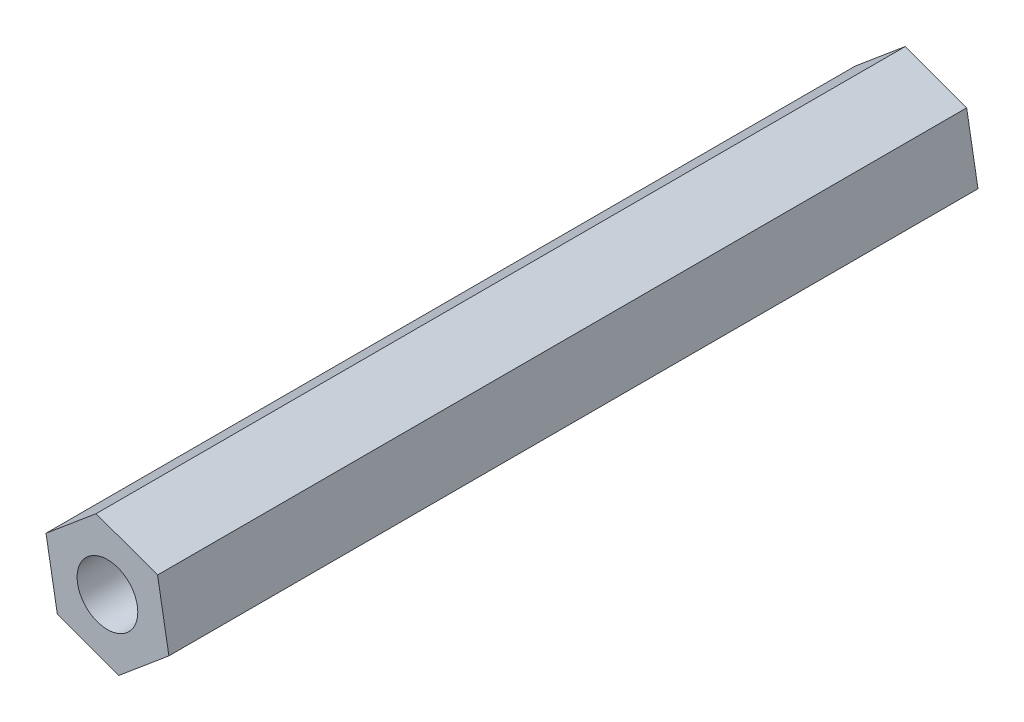
ISO-10303-21;
HEADER;
FILE_DESCRIPTION(('STEP AP214'),'2;1');
FILE_NAME('part.step','',(''),(''),'','','');
FILE_SCHEMA(('AUTOMOTIVE_DESIGN { 1 0 10303 214 1 1 1 1 }'));
ENDSEC;
DATA;
#1=APPLICATION_CONTEXT('core data for automotive mechanical design processes');
#2=APPLICATION_PROTOCOL_DEFINITION('international standard','automotive_design',2000,#1);
#3=PRODUCT_CONTEXT('',#1,'mechanical');
#4=PRODUCT('Part','Part','',(#3));
#5=PRODUCT_RELATED_PRODUCT_CATEGORY('part','',(#4));
#6=PRODUCT_DEFINITION_FORMATION('','',#4);
#7=PRODUCT_DEFINITION_CONTEXT('part definition',#1,'design');
#8=PRODUCT_DEFINITION('design','',#6,#7);
#9=PRODUCT_DEFINITION_SHAPE('','',#8);
#10=(LENGTH_UNIT() NAMED_UNIT(*) SI_UNIT(.MILLI.,.METRE.));
#11=(NAMED_UNIT(*) PLANE_ANGLE_UNIT() SI_UNIT($,.RADIAN.));
#12=(NAMED_UNIT(*) SI_UNIT($,.STERADIAN.) SOLID_ANGLE_UNIT());
#13=UNCERTAINTY_MEASURE_WITH_UNIT(LENGTH_MEASURE(1.E-05),#10,'distance_accuracy_value','');
#14=(GEOMETRIC_REPRESENTATION_CONTEXT(3) GLOBAL_UNCERTAINTY_ASSIGNED_CONTEXT((#13)) GLOBAL_UNIT_ASSIGNED_CONTEXT((#10,
#11,#12)) REPRESENTATION_CONTEXT('',''));
#15=CARTESIAN_POINT('',(0.,0.,0.));
#16=DIRECTION('',(0.,0.,1.));
#17=DIRECTION('',(1.,0.,0.));
#18=AXIS2_PLACEMENT_3D('',#15,#16,#17);
#19=CARTESIAN_POINT('',(0.,0.,40.));
#20=DIRECTION('',(0.,0.,1.));
#21=DIRECTION('',(1.,0.,0.));
#22=AXIS2_PLACEMENT_3D('',#19,#20,#21);
#23=PLANE('',#22);
#24=DIRECTION('',(0.939548933565756,-0.342414662997147,0.));
#25=VECTOR('',#24,1.);
#26=CARTESIAN_POINT('',(-132.779270137483,-55.9793424510125,40.));
#27=LINE('',#26,#25);
#28=CARTESIAN_POINT('',(-132.779270137483,-55.9793424510125,40.));
#29=VERTEX_POINT('',#28);
#30=CARTESIAN_POINT('',(-129.741556691102,-57.0864243590054,40.));
#31=VERTEX_POINT('',#30);
#32=EDGE_CURVE('E135',#29,#31,#27,.T.);
#33=ORIENTED_EDGE('',*,*,#32,.T.);
#34=DIRECTION('',(0.766314263566697,0.642465913067947,0.));
#35=VECTOR('',#34,1.);
#36=CARTESIAN_POINT('',(-129.741556691102,-57.0864243590054,40.));
#37=LINE('',#36,#35);
#38=CARTESIAN_POINT('',(-127.263938911519,-55.0092282990178,40.));
#39=VERTEX_POINT('',#38);
#40=EDGE_CURVE('E93',#31,#39,#37,.T.);
#41=ORIENTED_EDGE('',*,*,#40,.T.);
#42=DIRECTION('',(-0.173234669999057,0.984880576065097,0.));
#43=VECTOR('',#42,1.);
#44=CARTESIAN_POINT('',(-127.263938911519,-55.0092282990178,40.));
#45=LINE('',#44,#43);
#46=CARTESIAN_POINT('',(-127.824034578318,-51.8249503310372,40.));
#47=VERTEX_POINT('',#46);
#48=EDGE_CURVE('E106',#39,#47,#45,.T.);
#49=ORIENTED_EDGE('',*,*,#48,.T.);
#50=DIRECTION('',(-0.939548933565756,0.342414662997149,0.));
#51=VECTOR('',#50,1.);
#52=CARTESIAN_POINT('',(-127.824034578318,-51.8249503310372,40.));
#53=LINE('',#52,#51);
#54=CARTESIAN_POINT('',(-130.861748024699,-50.7178684230442,40.));
#55=VERTEX_POINT('',#54);
#56=EDGE_CURVE('E100',#47,#55,#53,.T.);
#57=ORIENTED_EDGE('',*,*,#56,.T.);
#58=DIRECTION('',(-0.766314263566692,-0.642465913067953,0.));
#59=VECTOR('',#58,1.);
#60=CARTESIAN_POINT('',(-130.861748024699,-50.7178684230442,40.));
#61=LINE('',#60,#59);
#62=CARTESIAN_POINT('',(-133.339365804282,-52.7950644830319,40.));
#63=VERTEX_POINT('',#62);
#64=EDGE_CURVE('E104',#55,#63,#61,.T.);
#65=ORIENTED_EDGE('',*,*,#64,.T.);
#66=DIRECTION('',(0.173234669999058,-0.984880576065097,0.));
#67=VECTOR('',#66,1.);
#68=CARTESIAN_POINT('',(-133.339365804282,-52.7950644830319,40.));
#69=LINE('',#68,#67);
#70=EDGE_CURVE('E56',#63,#29,#69,.T.);
#71=ORIENTED_EDGE('',*,*,#70,.T.);
#72=EDGE_LOOP('',(#33,#41,#49,#57,#65,#71));
#73=FACE_BOUND('',#72,.T.);
#74=CARTESIAN_POINT('',(-130.301652357901,-53.9021463910248,40.));
#75=DIRECTION('',(0.,0.,1.));
#76=DIRECTION('',(1.,0.,0.));
#77=AXIS2_PLACEMENT_3D('',#74,#75,#76);
#78=CIRCLE('',#77,1.5);
#79=CARTESIAN_POINT('',(-128.801652357901,-53.9021463910248,40.));
#80=VERTEX_POINT('',#79);
#81=EDGE_CURVE('E128',#80,#80,#78,.T.);
#82=ORIENTED_EDGE('',*,*,#81,.F.);
#83=EDGE_LOOP('',(#82));
#84=FACE_BOUND('',#83,.T.);
#85=ADVANCED_FACE('F39',(#73,#84),#23,.T.);
#86=CARTESIAN_POINT('',(0.,0.,0.));
#87=DIRECTION('',(0.,0.,1.));
#88=DIRECTION('',(1.,0.,0.));
#89=AXIS2_PLACEMENT_3D('',#86,#87,#88);
#90=PLANE('',#89);
#91=DIRECTION('',(0.939548933565756,-0.342414662997147,0.));
#92=VECTOR('',#91,1.);
#93=CARTESIAN_POINT('',(-132.779270137483,-55.9793424510125,0.));
#94=LINE('',#93,#92);
#95=CARTESIAN_POINT('',(-132.779270137483,-55.9793424510125,0.));
#96=VERTEX_POINT('',#95);
#97=CARTESIAN_POINT('',(-129.741556691102,-57.0864243590054,0.));
#98=VERTEX_POINT('',#97);
#99=EDGE_CURVE('E124',#96,#98,#94,.T.);
#100=ORIENTED_EDGE('',*,*,#99,.F.);
#101=DIRECTION('',(0.173234669999058,-0.984880576065097,0.));
#102=VECTOR('',#101,1.);
#103=CARTESIAN_POINT('',(-133.339365804282,-52.7950644830319,0.));
#104=LINE('',#103,#102);
#105=CARTESIAN_POINT('',(-133.339365804282,-52.7950644830319,0.));
#106=VERTEX_POINT('',#105);
#107=EDGE_CURVE('E85',#106,#96,#104,.T.);
#108=ORIENTED_EDGE('',*,*,#107,.F.);
#109=DIRECTION('',(-0.766314263566692,-0.642465913067953,0.));
#110=VECTOR('',#109,1.);
#111=CARTESIAN_POINT('',(-130.861748024699,-50.7178684230442,0.));
#112=LINE('',#111,#110);
#113=CARTESIAN_POINT('',(-130.861748024699,-50.7178684230442,0.));
#114=VERTEX_POINT('',#113);
#115=EDGE_CURVE('E79',#114,#106,#112,.T.);
#116=ORIENTED_EDGE('',*,*,#115,.F.);
#117=DIRECTION('',(-0.939548933565756,0.342414662997149,0.));
#118=VECTOR('',#117,1.);
#119=CARTESIAN_POINT('',(-127.824034578318,-51.8249503310372,0.));
#120=LINE('',#119,#118);
#121=CARTESIAN_POINT('',(-127.824034578318,-51.8249503310372,0.));
#122=VERTEX_POINT('',#121);
#123=EDGE_CURVE('E114',#122,#114,#120,.T.);
#124=ORIENTED_EDGE('',*,*,#123,.F.);
#125=DIRECTION('',(-0.173234669999057,0.984880576065097,0.));
#126=VECTOR('',#125,1.);
#127=CARTESIAN_POINT('',(-127.263938911519,-55.0092282990178,0.));
#128=LINE('',#127,#126);
#129=CARTESIAN_POINT('',(-127.263938911519,-55.0092282990178,0.));
#130=VERTEX_POINT('',#129);
#131=EDGE_CURVE('E130',#130,#122,#128,.T.);
#132=ORIENTED_EDGE('',*,*,#131,.F.);
#133=DIRECTION('',(0.766314263566697,0.642465913067947,0.));
#134=VECTOR('',#133,1.);
#135=CARTESIAN_POINT('',(-129.741556691102,-57.0864243590054,0.));
#136=LINE('',#135,#134);
#137=EDGE_CURVE('E127',#98,#130,#136,.T.);
#138=ORIENTED_EDGE('',*,*,#137,.F.);
#139=EDGE_LOOP('',(#100,#108,#116,#124,#132,#138));
#140=FACE_BOUND('',#139,.T.);
#141=CARTESIAN_POINT('',(-130.301652357901,-53.9021463910248,0.));
#142=DIRECTION('',(0.,0.,1.));
#143=DIRECTION('',(1.,0.,0.));
#144=AXIS2_PLACEMENT_3D('',#141,#142,#143);
#145=CIRCLE('',#144,1.5);
#146=CARTESIAN_POINT('',(-128.801652357901,-53.9021463910248,0.));
#147=VERTEX_POINT('',#146);
#148=EDGE_CURVE('E246',#147,#147,#145,.T.);
#149=ORIENTED_EDGE('',*,*,#148,.T.);
#150=EDGE_LOOP('',(#149));
#151=FACE_BOUND('',#150,.T.);
#152=ADVANCED_FACE('F144',(#140,#151),#90,.F.);
#153=CARTESIAN_POINT('',(-132.779270137483,-55.9793424510125,40.));
#154=DIRECTION('',(0.342414662997147,0.939548933565757,0.));
#155=DIRECTION('',(-0.939548933565757,0.342414662997147,0.));
#156=AXIS2_PLACEMENT_3D('',#153,#154,#155);
#157=PLANE('',#156);
#158=ORIENTED_EDGE('',*,*,#99,.T.);
#159=DIRECTION('',(0.,0.,-1.));
#160=VECTOR('',#159,1.);
#161=CARTESIAN_POINT('',(-129.741556691102,-57.0864243590054,40.));
#162=LINE('',#161,#160);
#163=EDGE_CURVE('E11',#31,#98,#162,.T.);
#164=ORIENTED_EDGE('',*,*,#163,.F.);
#165=ORIENTED_EDGE('',*,*,#32,.F.);
#166=DIRECTION('',(0.,0.,-1.));
#167=VECTOR('',#166,1.);
#168=CARTESIAN_POINT('',(-132.779270137483,-55.9793424510125,40.));
#169=LINE('',#168,#167);
#170=EDGE_CURVE('E120',#29,#96,#169,.T.);
#171=ORIENTED_EDGE('',*,*,#170,.T.);
#172=EDGE_LOOP('',(#158,#164,#165,#171));
#173=FACE_BOUND('',#172,.T.);
#174=ADVANCED_FACE('F41',(#173),#157,.F.);
#175=CARTESIAN_POINT('',(-129.741556691102,-57.0864243590054,40.));
#176=DIRECTION('',(-0.642465913067947,0.766314263566697,0.));
#177=DIRECTION('',(-0.766314263566697,-0.642465913067947,0.));
#178=AXIS2_PLACEMENT_3D('',#175,#176,#177);
#179=PLANE('',#178);
#180=ORIENTED_EDGE('',*,*,#137,.T.);
#181=DIRECTION('',(0.,0.,-1.));
#182=VECTOR('',#181,1.);
#183=CARTESIAN_POINT('',(-127.263938911519,-55.0092282990178,40.));
#184=LINE('',#183,#182);
#185=EDGE_CURVE('E48',#39,#130,#184,.T.);
#186=ORIENTED_EDGE('',*,*,#185,.F.);
#187=ORIENTED_EDGE('',*,*,#40,.F.);
#188=ORIENTED_EDGE('',*,*,#163,.T.);
#189=EDGE_LOOP('',(#180,#186,#187,#188));
#190=FACE_BOUND('',#189,.T.);
#191=ADVANCED_FACE('F169',(#190),#179,.F.);
#192=CARTESIAN_POINT('',(-127.263938911519,-55.0092282990178,40.));
#193=DIRECTION('',(-0.984880576065097,-0.173234669999057,0.));
#194=DIRECTION('',(0.173234669999057,-0.984880576065097,0.));
#195=AXIS2_PLACEMENT_3D('',#192,#193,#194);
#196=PLANE('',#195);
#197=ORIENTED_EDGE('',*,*,#131,.T.);
#198=DIRECTION('',(0.,0.,-1.));
#199=VECTOR('',#198,1.);
#200=CARTESIAN_POINT('',(-127.824034578318,-51.8249503310372,40.));
#201=LINE('',#200,#199);
#202=EDGE_CURVE('E115',#47,#122,#201,.T.);
#203=ORIENTED_EDGE('',*,*,#202,.F.);
#204=ORIENTED_EDGE('',*,*,#48,.F.);
#205=ORIENTED_EDGE('',*,*,#185,.T.);
#206=EDGE_LOOP('',(#197,#203,#204,#205));
#207=FACE_BOUND('',#206,.T.);
#208=ADVANCED_FACE('F141',(#207),#196,.F.);
#209=CARTESIAN_POINT('',(-127.824034578318,-51.8249503310372,40.));
#210=DIRECTION('',(-0.342414662997149,-0.939548933565756,0.));
#211=DIRECTION('',(0.939548933565756,-0.342414662997149,0.));
#212=AXIS2_PLACEMENT_3D('',#209,#210,#211);
#213=PLANE('',#212);
#214=ORIENTED_EDGE('',*,*,#123,.T.);
#215=DIRECTION('',(0.,0.,-1.));
#216=VECTOR('',#215,1.);
#217=CARTESIAN_POINT('',(-130.861748024699,-50.7178684230442,40.));
#218=LINE('',#217,#216);
#219=EDGE_CURVE('E111',#55,#114,#218,.T.);
#220=ORIENTED_EDGE('',*,*,#219,.F.);
#221=ORIENTED_EDGE('',*,*,#56,.F.);
#222=ORIENTED_EDGE('',*,*,#202,.T.);
#223=EDGE_LOOP('',(#214,#220,#221,#222));
#224=FACE_BOUND('',#223,.T.);
#225=ADVANCED_FACE('F112',(#224),#213,.F.);
#226=CARTESIAN_POINT('',(-130.861748024699,-50.7178684230442,40.));
#227=DIRECTION('',(0.642465913067953,-0.766314263566692,0.));
#228=DIRECTION('',(0.766314263566692,0.642465913067953,0.));
#229=AXIS2_PLACEMENT_3D('',#226,#227,#228);
#230=PLANE('',#229);
#231=ORIENTED_EDGE('',*,*,#115,.T.);
#232=DIRECTION('',(0.,0.,-1.));
#233=VECTOR('',#232,1.);
#234=CARTESIAN_POINT('',(-133.339365804282,-52.7950644830319,40.));
#235=LINE('',#234,#233);
#236=EDGE_CURVE('E116',#63,#106,#235,.T.);
#237=ORIENTED_EDGE('',*,*,#236,.F.);
#238=ORIENTED_EDGE('',*,*,#64,.F.);
#239=ORIENTED_EDGE('',*,*,#219,.T.);
#240=EDGE_LOOP('',(#231,#237,#238,#239));
#241=FACE_BOUND('',#240,.T.);
#242=ADVANCED_FACE('F118',(#241),#230,.F.);
#243=CARTESIAN_POINT('',(-133.339365804282,-52.7950644830319,40.));
#244=DIRECTION('',(0.984880576065097,0.173234669999058,0.));
#245=DIRECTION('',(-0.173234669999058,0.984880576065097,0.));
#246=AXIS2_PLACEMENT_3D('',#243,#244,#245);
#247=PLANE('',#246);
#248=ORIENTED_EDGE('',*,*,#107,.T.);
#249=ORIENTED_EDGE('',*,*,#170,.F.);
#250=ORIENTED_EDGE('',*,*,#70,.F.);
#251=ORIENTED_EDGE('',*,*,#236,.T.);
#252=EDGE_LOOP('',(#248,#249,#250,#251));
#253=FACE_BOUND('',#252,.T.);
#254=ADVANCED_FACE('F149',(#253),#247,.F.);
#255=CARTESIAN_POINT('',(-130.301652357901,-53.9021463910248,40.));
#256=DIRECTION('',(0.,0.,-1.));
#257=DIRECTION('',(-1.,0.,0.));
#258=AXIS2_PLACEMENT_3D('',#255,#256,#257);
#259=CYLINDRICAL_SURFACE('',#258,1.5);
#260=ORIENTED_EDGE('',*,*,#81,.T.);
#261=EDGE_LOOP('',(#260));
#262=FACE_BOUND('',#261,.T.);
#263=ORIENTED_EDGE('',*,*,#148,.F.);
#264=EDGE_LOOP('',(#263));
#265=FACE_BOUND('',#264,.T.);
#266=ADVANCED_FACE('F151',(#262,#265),#259,.F.);
#267=CLOSED_SHELL('',(#85,#152,#174,#191,#208,#225,#242,#254,#266));
#268=MANIFOLD_SOLID_BREP('B2',#267);
#269=ADVANCED_BREP_SHAPE_REPRESENTATION('',(#18,#268),#14);
#270=SHAPE_DEFINITION_REPRESENTATION(#9,#269);
ENDSEC;
END-ISO-10303-21;
